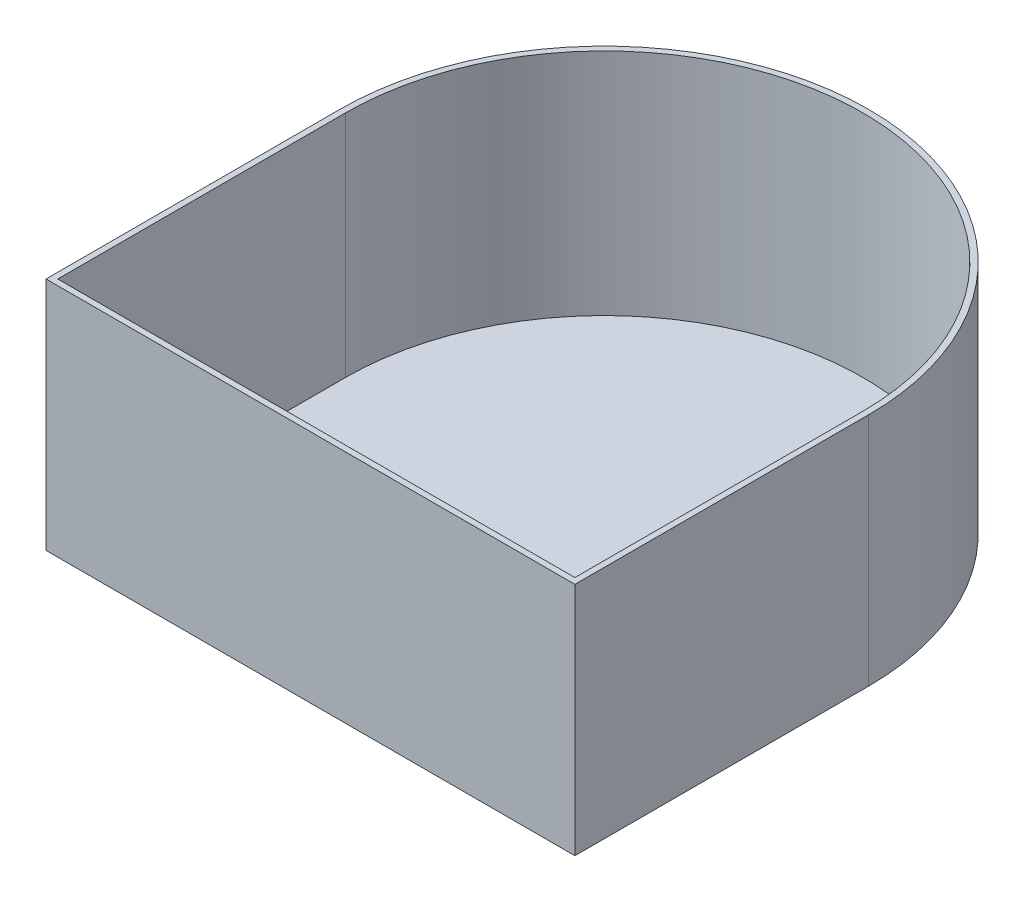
ISO-10303-21;
HEADER;
FILE_DESCRIPTION(('STEP AP214'),'2;1');
FILE_NAME('part.step','',(''),(''),'','','');
FILE_SCHEMA(('AUTOMOTIVE_DESIGN { 1 0 10303 214 1 1 1 1 }'));
ENDSEC;
DATA;
#1=APPLICATION_CONTEXT('core data for automotive mechanical design processes');
#2=APPLICATION_PROTOCOL_DEFINITION('international standard','automotive_design',2000,#1);
#3=PRODUCT_CONTEXT('',#1,'mechanical');
#4=PRODUCT('Part','Part','',(#3));
#5=PRODUCT_RELATED_PRODUCT_CATEGORY('part','',(#4));
#6=PRODUCT_DEFINITION_FORMATION('','',#4);
#7=PRODUCT_DEFINITION_CONTEXT('part definition',#1,'design');
#8=PRODUCT_DEFINITION('design','',#6,#7);
#9=PRODUCT_DEFINITION_SHAPE('','',#8);
#10=(LENGTH_UNIT() NAMED_UNIT(*) SI_UNIT(.MILLI.,.METRE.));
#11=(NAMED_UNIT(*) PLANE_ANGLE_UNIT() SI_UNIT($,.RADIAN.));
#12=(NAMED_UNIT(*) SI_UNIT($,.STERADIAN.) SOLID_ANGLE_UNIT());
#13=UNCERTAINTY_MEASURE_WITH_UNIT(LENGTH_MEASURE(1.E-05),#10,'distance_accuracy_value','');
#14=(GEOMETRIC_REPRESENTATION_CONTEXT(3) GLOBAL_UNCERTAINTY_ASSIGNED_CONTEXT((#13)) GLOBAL_UNIT_ASSIGNED_CONTEXT((#10,
#11,#12)) REPRESENTATION_CONTEXT('',''));
#15=CARTESIAN_POINT('',(0.,0.,0.));
#16=DIRECTION('',(0.,0.,1.));
#17=DIRECTION('',(1.,0.,0.));
#18=AXIS2_PLACEMENT_3D('',#15,#16,#17);
#19=CARTESIAN_POINT('',(0.,40.,0.));
#20=DIRECTION('',(0.,-1.,0.));
#21=DIRECTION('',(0.,0.,-1.));
#22=AXIS2_PLACEMENT_3D('',#19,#20,#21);
#23=PLANE('',#22);
#24=CARTESIAN_POINT('',(0.,40.,0.));
#25=DIRECTION('',(0.,1.,0.));
#26=DIRECTION('',(0.,0.,-1.));
#27=AXIS2_PLACEMENT_3D('',#24,#25,#26);
#28=CIRCLE('',#27,45.);
#29=CARTESIAN_POINT('',(45.,40.,0.));
#30=VERTEX_POINT('',#29);
#31=CARTESIAN_POINT('',(-45.,40.,0.));
#32=VERTEX_POINT('',#31);
#33=EDGE_CURVE('E141',#30,#32,#28,.T.);
#34=ORIENTED_EDGE('',*,*,#33,.T.);
#35=DIRECTION('',(0.,0.,1.));
#36=VECTOR('',#35,1.);
#37=CARTESIAN_POINT('',(-45.,40.,0.));
#38=LINE('',#37,#36);
#39=CARTESIAN_POINT('',(-45.,40.,50.));
#40=VERTEX_POINT('',#39);
#41=EDGE_CURVE('E85',#32,#40,#38,.T.);
#42=ORIENTED_EDGE('',*,*,#41,.T.);
#43=DIRECTION('',(1.,0.,0.));
#44=VECTOR('',#43,1.);
#45=CARTESIAN_POINT('',(-45.,40.,50.));
#46=LINE('',#45,#44);
#47=CARTESIAN_POINT('',(45.,40.,50.));
#48=VERTEX_POINT('',#47);
#49=EDGE_CURVE('E144',#40,#48,#46,.T.);
#50=ORIENTED_EDGE('',*,*,#49,.T.);
#51=DIRECTION('',(0.,0.,-1.));
#52=VECTOR('',#51,1.);
#53=CARTESIAN_POINT('',(45.,40.,50.));
#54=LINE('',#53,#52);
#55=EDGE_CURVE('E57',#48,#30,#54,.T.);
#56=ORIENTED_EDGE('',*,*,#55,.T.);
#57=EDGE_LOOP('',(#34,#42,#50,#56));
#58=FACE_BOUND('',#57,.T.);
#59=CARTESIAN_POINT('',(0.,40.,0.));
#60=DIRECTION('',(0.,-1.,0.));
#61=DIRECTION('',(0.,0.,-1.));
#62=AXIS2_PLACEMENT_3D('',#59,#60,#61);
#63=CIRCLE('',#62,44.);
#64=CARTESIAN_POINT('',(44.,40.,0.));
#65=VERTEX_POINT('',#64);
#66=CARTESIAN_POINT('',(-44.,40.,0.));
#67=VERTEX_POINT('',#66);
#68=EDGE_CURVE('E130',#65,#67,#63,.F.);
#69=ORIENTED_EDGE('',*,*,#68,.F.);
#70=DIRECTION('',(0.,0.,-1.));
#71=VECTOR('',#70,1.);
#72=CARTESIAN_POINT('',(44.,40.,0.));
#73=LINE('',#72,#71);
#74=CARTESIAN_POINT('',(44.,40.,49.));
#75=VERTEX_POINT('',#74);
#76=EDGE_CURVE('E139',#75,#65,#73,.T.);
#77=ORIENTED_EDGE('',*,*,#76,.F.);
#78=DIRECTION('',(1.,0.,0.));
#79=VECTOR('',#78,1.);
#80=CARTESIAN_POINT('',(0.,40.,49.));
#81=LINE('',#80,#79);
#82=CARTESIAN_POINT('',(-44.,40.,49.));
#83=VERTEX_POINT('',#82);
#84=EDGE_CURVE('E137',#83,#75,#81,.T.);
#85=ORIENTED_EDGE('',*,*,#84,.F.);
#86=DIRECTION('',(0.,0.,1.));
#87=VECTOR('',#86,1.);
#88=CARTESIAN_POINT('',(-44.,40.,0.));
#89=LINE('',#88,#87);
#90=EDGE_CURVE('E122',#67,#83,#89,.T.);
#91=ORIENTED_EDGE('',*,*,#90,.F.);
#92=EDGE_LOOP('',(#69,#77,#85,#91));
#93=FACE_BOUND('',#92,.T.);
#94=ADVANCED_FACE('F33',(#58,#93),#23,.F.);
#95=CARTESIAN_POINT('',(0.,40.,0.));
#96=DIRECTION('',(0.,-1.,0.));
#97=DIRECTION('',(0.,0.,-1.));
#98=AXIS2_PLACEMENT_3D('',#95,#96,#97);
#99=CYLINDRICAL_SURFACE('',#98,45.);
#100=CARTESIAN_POINT('',(0.,0.,0.));
#101=DIRECTION('',(0.,1.,0.));
#102=DIRECTION('',(0.,0.,-1.));
#103=AXIS2_PLACEMENT_3D('',#100,#101,#102);
#104=CIRCLE('',#103,45.);
#105=CARTESIAN_POINT('',(45.,0.,0.));
#106=VERTEX_POINT('',#105);
#107=CARTESIAN_POINT('',(-45.,0.,0.));
#108=VERTEX_POINT('',#107);
#109=EDGE_CURVE('E148',#106,#108,#104,.T.);
#110=ORIENTED_EDGE('',*,*,#109,.T.);
#111=DIRECTION('',(0.,-1.,0.));
#112=VECTOR('',#111,1.);
#113=CARTESIAN_POINT('',(-45.,40.,0.));
#114=LINE('',#113,#112);
#115=EDGE_CURVE('E11',#32,#108,#114,.T.);
#116=ORIENTED_EDGE('',*,*,#115,.F.);
#117=ORIENTED_EDGE('',*,*,#33,.F.);
#118=DIRECTION('',(0.,-1.,0.));
#119=VECTOR('',#118,1.);
#120=CARTESIAN_POINT('',(45.,40.,0.));
#121=LINE('',#120,#119);
#122=EDGE_CURVE('E147',#30,#106,#121,.T.);
#123=ORIENTED_EDGE('',*,*,#122,.T.);
#124=EDGE_LOOP('',(#110,#116,#117,#123));
#125=FACE_BOUND('',#124,.T.);
#126=ADVANCED_FACE('F35',(#125),#99,.T.);
#127=CARTESIAN_POINT('',(-45.,40.,0.));
#128=DIRECTION('',(1.,0.,0.));
#129=DIRECTION('',(0.,0.,-1.));
#130=AXIS2_PLACEMENT_3D('',#127,#128,#129);
#131=PLANE('',#130);
#132=DIRECTION('',(0.,0.,1.));
#133=VECTOR('',#132,1.);
#134=CARTESIAN_POINT('',(-45.,0.,0.));
#135=LINE('',#134,#133);
#136=CARTESIAN_POINT('',(-45.,0.,50.));
#137=VERTEX_POINT('',#136);
#138=EDGE_CURVE('E151',#108,#137,#135,.T.);
#139=ORIENTED_EDGE('',*,*,#138,.T.);
#140=DIRECTION('',(0.,-1.,0.));
#141=VECTOR('',#140,1.);
#142=CARTESIAN_POINT('',(-45.,40.,50.));
#143=LINE('',#142,#141);
#144=EDGE_CURVE('E41',#40,#137,#143,.T.);
#145=ORIENTED_EDGE('',*,*,#144,.F.);
#146=ORIENTED_EDGE('',*,*,#41,.F.);
#147=ORIENTED_EDGE('',*,*,#115,.T.);
#148=EDGE_LOOP('',(#139,#145,#146,#147));
#149=FACE_BOUND('',#148,.T.);
#150=ADVANCED_FACE('F179',(#149),#131,.F.);
#151=CARTESIAN_POINT('',(-45.,40.,50.));
#152=DIRECTION('',(0.,0.,-1.));
#153=DIRECTION('',(-1.,0.,0.));
#154=AXIS2_PLACEMENT_3D('',#151,#152,#153);
#155=PLANE('',#154);
#156=DIRECTION('',(1.,0.,0.));
#157=VECTOR('',#156,1.);
#158=CARTESIAN_POINT('',(-45.,0.,50.));
#159=LINE('',#158,#157);
#160=CARTESIAN_POINT('',(45.,0.,50.));
#161=VERTEX_POINT('',#160);
#162=EDGE_CURVE('E153',#137,#161,#159,.T.);
#163=ORIENTED_EDGE('',*,*,#162,.T.);
#164=DIRECTION('',(0.,-1.,0.));
#165=VECTOR('',#164,1.);
#166=CARTESIAN_POINT('',(45.,40.,50.));
#167=LINE('',#166,#165);
#168=EDGE_CURVE('E157',#48,#161,#167,.T.);
#169=ORIENTED_EDGE('',*,*,#168,.F.);
#170=ORIENTED_EDGE('',*,*,#49,.F.);
#171=ORIENTED_EDGE('',*,*,#144,.T.);
#172=EDGE_LOOP('',(#163,#169,#170,#171));
#173=FACE_BOUND('',#172,.T.);
#174=ADVANCED_FACE('F162',(#173),#155,.F.);
#175=CARTESIAN_POINT('',(45.,40.,50.));
#176=DIRECTION('',(-1.,0.,0.));
#177=DIRECTION('',(0.,0.,1.));
#178=AXIS2_PLACEMENT_3D('',#175,#176,#177);
#179=PLANE('',#178);
#180=DIRECTION('',(0.,0.,-1.));
#181=VECTOR('',#180,1.);
#182=CARTESIAN_POINT('',(45.,0.,50.));
#183=LINE('',#182,#181);
#184=EDGE_CURVE('E78',#161,#106,#183,.T.);
#185=ORIENTED_EDGE('',*,*,#184,.T.);
#186=ORIENTED_EDGE('',*,*,#122,.F.);
#187=ORIENTED_EDGE('',*,*,#55,.F.);
#188=ORIENTED_EDGE('',*,*,#168,.T.);
#189=EDGE_LOOP('',(#185,#186,#187,#188));
#190=FACE_BOUND('',#189,.T.);
#191=ADVANCED_FACE('F170',(#190),#179,.F.);
#192=CARTESIAN_POINT('',(0.,0.,0.));
#193=DIRECTION('',(0.,-1.,0.));
#194=DIRECTION('',(0.,0.,-1.));
#195=AXIS2_PLACEMENT_3D('',#192,#193,#194);
#196=PLANE('',#195);
#197=ORIENTED_EDGE('',*,*,#109,.F.);
#198=ORIENTED_EDGE('',*,*,#184,.F.);
#199=ORIENTED_EDGE('',*,*,#162,.F.);
#200=ORIENTED_EDGE('',*,*,#138,.F.);
#201=EDGE_LOOP('',(#197,#198,#199,#200));
#202=FACE_BOUND('',#201,.T.);
#203=ADVANCED_FACE('F166',(#202),#196,.T.);
#204=CARTESIAN_POINT('',(0.,40.,0.));
#205=DIRECTION('',(0.,-1.,0.));
#206=DIRECTION('',(0.,0.,-1.));
#207=AXIS2_PLACEMENT_3D('',#204,#205,#206);
#208=CYLINDRICAL_SURFACE('',#207,44.);
#209=CARTESIAN_POINT('',(0.,1.,0.));
#210=DIRECTION('',(0.,-1.,0.));
#211=DIRECTION('',(0.,0.,-1.));
#212=AXIS2_PLACEMENT_3D('',#209,#210,#211);
#213=CIRCLE('',#212,44.);
#214=CARTESIAN_POINT('',(44.,1.,0.));
#215=VERTEX_POINT('',#214);
#216=CARTESIAN_POINT('',(-44.,1.,0.));
#217=VERTEX_POINT('',#216);
#218=EDGE_CURVE('E113',#215,#217,#213,.F.);
#219=ORIENTED_EDGE('',*,*,#218,.F.);
#220=DIRECTION('',(0.,-1.,0.));
#221=VECTOR('',#220,1.);
#222=CARTESIAN_POINT('',(44.,40.,0.));
#223=LINE('',#222,#221);
#224=EDGE_CURVE('E133',#65,#215,#223,.T.);
#225=ORIENTED_EDGE('',*,*,#224,.F.);
#226=ORIENTED_EDGE('',*,*,#68,.T.);
#227=DIRECTION('',(0.,1.,0.));
#228=VECTOR('',#227,1.);
#229=CARTESIAN_POINT('',(-44.,40.,0.));
#230=LINE('',#229,#228);
#231=EDGE_CURVE('E125',#67,#217,#230,.F.);
#232=ORIENTED_EDGE('',*,*,#231,.T.);
#233=EDGE_LOOP('',(#219,#225,#226,#232));
#234=FACE_BOUND('',#233,.T.);
#235=ADVANCED_FACE('F177',(#234),#208,.F.);
#236=CARTESIAN_POINT('',(-44.,40.,0.));
#237=DIRECTION('',(1.,0.,0.));
#238=DIRECTION('',(0.,0.,-1.));
#239=AXIS2_PLACEMENT_3D('',#236,#237,#238);
#240=PLANE('',#239);
#241=DIRECTION('',(0.,0.,1.));
#242=VECTOR('',#241,1.);
#243=CARTESIAN_POINT('',(-44.,1.,0.));
#244=LINE('',#243,#242);
#245=CARTESIAN_POINT('',(-44.,1.,49.));
#246=VERTEX_POINT('',#245);
#247=EDGE_CURVE('E107',#217,#246,#244,.T.);
#248=ORIENTED_EDGE('',*,*,#247,.F.);
#249=ORIENTED_EDGE('',*,*,#231,.F.);
#250=ORIENTED_EDGE('',*,*,#90,.T.);
#251=DIRECTION('',(0.,-1.,0.));
#252=VECTOR('',#251,1.);
#253=CARTESIAN_POINT('',(-44.,40.,49.));
#254=LINE('',#253,#252);
#255=EDGE_CURVE('E119',#83,#246,#254,.T.);
#256=ORIENTED_EDGE('',*,*,#255,.T.);
#257=EDGE_LOOP('',(#248,#249,#250,#256));
#258=FACE_BOUND('',#257,.T.);
#259=ADVANCED_FACE('F120',(#258),#240,.T.);
#260=CARTESIAN_POINT('',(-45.,40.,49.));
#261=DIRECTION('',(0.,0.,-1.));
#262=DIRECTION('',(-1.,0.,0.));
#263=AXIS2_PLACEMENT_3D('',#260,#261,#262);
#264=PLANE('',#263);
#265=DIRECTION('',(1.,0.,0.));
#266=VECTOR('',#265,1.);
#267=CARTESIAN_POINT('',(0.,1.,49.));
#268=LINE('',#267,#266);
#269=CARTESIAN_POINT('',(44.,1.,49.));
#270=VERTEX_POINT('',#269);
#271=EDGE_CURVE('E111',#246,#270,#268,.T.);
#272=ORIENTED_EDGE('',*,*,#271,.F.);
#273=ORIENTED_EDGE('',*,*,#255,.F.);
#274=ORIENTED_EDGE('',*,*,#84,.T.);
#275=DIRECTION('',(0.,-1.,0.));
#276=VECTOR('',#275,1.);
#277=CARTESIAN_POINT('',(44.,40.,49.));
#278=LINE('',#277,#276);
#279=EDGE_CURVE('E48',#75,#270,#278,.T.);
#280=ORIENTED_EDGE('',*,*,#279,.T.);
#281=EDGE_LOOP('',(#272,#273,#274,#280));
#282=FACE_BOUND('',#281,.T.);
#283=ADVANCED_FACE('F127',(#282),#264,.T.);
#284=CARTESIAN_POINT('',(44.,40.,50.));
#285=DIRECTION('',(-1.,0.,0.));
#286=DIRECTION('',(0.,0.,1.));
#287=AXIS2_PLACEMENT_3D('',#284,#285,#286);
#288=PLANE('',#287);
#289=DIRECTION('',(0.,0.,-1.));
#290=VECTOR('',#289,1.);
#291=CARTESIAN_POINT('',(44.,1.,0.));
#292=LINE('',#291,#290);
#293=EDGE_CURVE('E128',#270,#215,#292,.T.);
#294=ORIENTED_EDGE('',*,*,#293,.F.);
#295=ORIENTED_EDGE('',*,*,#279,.F.);
#296=ORIENTED_EDGE('',*,*,#76,.T.);
#297=ORIENTED_EDGE('',*,*,#224,.T.);
#298=EDGE_LOOP('',(#294,#295,#296,#297));
#299=FACE_BOUND('',#298,.T.);
#300=ADVANCED_FACE('F190',(#299),#288,.T.);
#301=CARTESIAN_POINT('',(0.,1.,0.));
#302=DIRECTION('',(0.,-1.,0.));
#303=DIRECTION('',(0.,0.,-1.));
#304=AXIS2_PLACEMENT_3D('',#301,#302,#303);
#305=PLANE('',#304);
#306=ORIENTED_EDGE('',*,*,#218,.T.);
#307=ORIENTED_EDGE('',*,*,#247,.T.);
#308=ORIENTED_EDGE('',*,*,#271,.T.);
#309=ORIENTED_EDGE('',*,*,#293,.T.);
#310=EDGE_LOOP('',(#306,#307,#308,#309));
#311=FACE_BOUND('',#310,.T.);
#312=ADVANCED_FACE('F109',(#311),#305,.F.);
#313=CLOSED_SHELL('',(#94,#126,#150,#174,#191,#203,#235,#259,#283,#300,#312));
#314=MANIFOLD_SOLID_BREP('B2',#313);
#315=ADVANCED_BREP_SHAPE_REPRESENTATION('',(#18,#314),#14);
#316=SHAPE_DEFINITION_REPRESENTATION(#9,#315);
ENDSEC;
END-ISO-10303-21;
